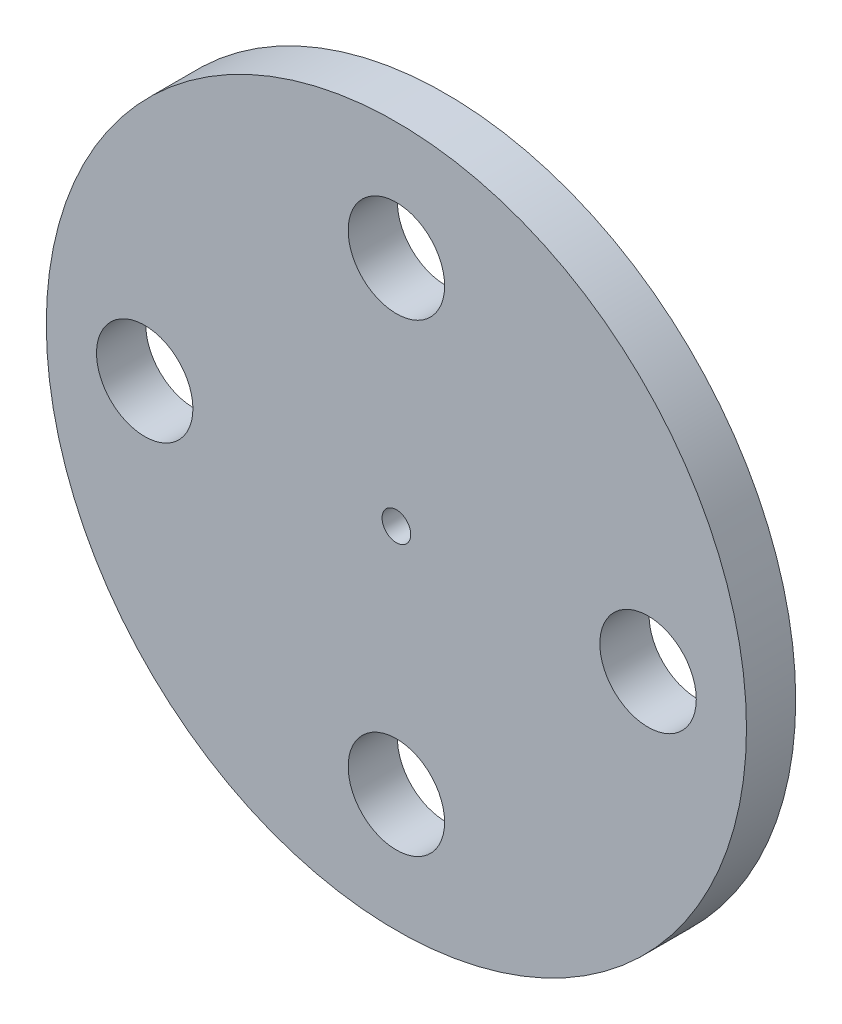
ISO-10303-21;
HEADER;
FILE_DESCRIPTION(('STEP AP214'),'2;1');
FILE_NAME('part.step','',(''),(''),'','','');
FILE_SCHEMA(('AUTOMOTIVE_DESIGN { 1 0 10303 214 1 1 1 1 }'));
ENDSEC;
DATA;
#1=APPLICATION_CONTEXT('core data for automotive mechanical design processes');
#2=APPLICATION_PROTOCOL_DEFINITION('international standard','automotive_design',2000,#1);
#3=PRODUCT_CONTEXT('',#1,'mechanical');
#4=PRODUCT('Part','Part','',(#3));
#5=PRODUCT_RELATED_PRODUCT_CATEGORY('part','',(#4));
#6=PRODUCT_DEFINITION_FORMATION('','',#4);
#7=PRODUCT_DEFINITION_CONTEXT('part definition',#1,'design');
#8=PRODUCT_DEFINITION('design','',#6,#7);
#9=PRODUCT_DEFINITION_SHAPE('','',#8);
#10=(LENGTH_UNIT() NAMED_UNIT(*) SI_UNIT(.MILLI.,.METRE.));
#11=(NAMED_UNIT(*) PLANE_ANGLE_UNIT() SI_UNIT($,.RADIAN.));
#12=(NAMED_UNIT(*) SI_UNIT($,.STERADIAN.) SOLID_ANGLE_UNIT());
#13=UNCERTAINTY_MEASURE_WITH_UNIT(LENGTH_MEASURE(1.E-05),#10,'distance_accuracy_value','');
#14=(GEOMETRIC_REPRESENTATION_CONTEXT(3) GLOBAL_UNCERTAINTY_ASSIGNED_CONTEXT((#13)) GLOBAL_UNIT_ASSIGNED_CONTEXT((#10,
#11,#12)) REPRESENTATION_CONTEXT('',''));
#15=CARTESIAN_POINT('',(0.,0.,0.));
#16=DIRECTION('',(0.,0.,1.));
#17=DIRECTION('',(1.,0.,0.));
#18=AXIS2_PLACEMENT_3D('',#15,#16,#17);
#19=CARTESIAN_POINT('',(0.,0.,3.18));
#20=DIRECTION('',(0.,0.,1.));
#21=DIRECTION('',(1.,0.,0.));
#22=AXIS2_PLACEMENT_3D('',#19,#20,#21);
#23=PLANE('',#22);
#24=CARTESIAN_POINT('',(16.2559285671691,0.,3.18));
#25=DIRECTION('',(0.,0.,1.));
#26=DIRECTION('',(1.,0.,0.));
#27=AXIS2_PLACEMENT_3D('',#24,#25,#26);
#28=CIRCLE('',#27,3.115);
#29=CARTESIAN_POINT('',(19.3709285671691,0.,3.18));
#30=VERTEX_POINT('',#29);
#31=EDGE_CURVE('E72',#30,#30,#28,.T.);
#32=ORIENTED_EDGE('',*,*,#31,.F.);
#33=EDGE_LOOP('',(#32));
#34=FACE_BOUND('',#33,.T.);
#35=CARTESIAN_POINT('',(-16.2559285671691,0.,3.18));
#36=DIRECTION('',(0.,0.,1.));
#37=DIRECTION('',(1.,0.,0.));
#38=AXIS2_PLACEMENT_3D('',#35,#36,#37);
#39=CIRCLE('',#38,3.11280836168759);
#40=CARTESIAN_POINT('',(-13.1431202054815,0.,3.18));
#41=VERTEX_POINT('',#40);
#42=EDGE_CURVE('E56',#41,#41,#39,.T.);
#43=ORIENTED_EDGE('',*,*,#42,.F.);
#44=EDGE_LOOP('',(#43));
#45=FACE_BOUND('',#44,.T.);
#46=CARTESIAN_POINT('',(0.,0.,3.18));
#47=DIRECTION('',(0.,0.,1.));
#48=DIRECTION('',(1.,0.,0.));
#49=AXIS2_PLACEMENT_3D('',#46,#47,#48);
#50=CIRCLE('',#49,22.6142804477584);
#51=CARTESIAN_POINT('',(22.6142804477584,0.,3.18));
#52=VERTEX_POINT('',#51);
#53=EDGE_CURVE('E10',#52,#52,#50,.T.);
#54=ORIENTED_EDGE('',*,*,#53,.T.);
#55=EDGE_LOOP('',(#54));
#56=FACE_BOUND('',#55,.T.);
#57=CARTESIAN_POINT('',(0.,0.,3.18));
#58=DIRECTION('',(0.,0.,1.));
#59=DIRECTION('',(1.,0.,0.));
#60=AXIS2_PLACEMENT_3D('',#57,#58,#59);
#61=CIRCLE('',#60,0.925000000000001);
#62=CARTESIAN_POINT('',(0.925000000000001,0.,3.18));
#63=VERTEX_POINT('',#62);
#64=EDGE_CURVE('E50',#63,#63,#61,.T.);
#65=ORIENTED_EDGE('',*,*,#64,.F.);
#66=EDGE_LOOP('',(#65));
#67=FACE_BOUND('',#66,.T.);
#68=CARTESIAN_POINT('',(0.,-15.,3.18));
#69=DIRECTION('',(0.,0.,1.));
#70=DIRECTION('',(1.,0.,0.));
#71=AXIS2_PLACEMENT_3D('',#68,#69,#70);
#72=CIRCLE('',#71,3.115);
#73=CARTESIAN_POINT('',(3.115,-15.,3.18));
#74=VERTEX_POINT('',#73);
#75=EDGE_CURVE('E64',#74,#74,#72,.T.);
#76=ORIENTED_EDGE('',*,*,#75,.F.);
#77=EDGE_LOOP('',(#76));
#78=FACE_BOUND('',#77,.T.);
#79=CARTESIAN_POINT('',(0.,15.,3.18));
#80=DIRECTION('',(0.,0.,1.));
#81=DIRECTION('',(1.,0.,0.));
#82=AXIS2_PLACEMENT_3D('',#79,#80,#81);
#83=CIRCLE('',#82,3.115);
#84=CARTESIAN_POINT('',(3.115,15.,3.18));
#85=VERTEX_POINT('',#84);
#86=EDGE_CURVE('E80',#85,#85,#83,.T.);
#87=ORIENTED_EDGE('',*,*,#86,.F.);
#88=EDGE_LOOP('',(#87));
#89=FACE_BOUND('',#88,.T.);
#90=ADVANCED_FACE('F37',(#34,#45,#56,#67,#78,#89),#23,.T.);
#91=CARTESIAN_POINT('',(0.,0.,0.));
#92=DIRECTION('',(0.,0.,1.));
#93=DIRECTION('',(1.,0.,0.));
#94=AXIS2_PLACEMENT_3D('',#91,#92,#93);
#95=PLANE('',#94);
#96=CARTESIAN_POINT('',(0.,0.,0.));
#97=DIRECTION('',(0.,0.,1.));
#98=DIRECTION('',(1.,0.,0.));
#99=AXIS2_PLACEMENT_3D('',#96,#97,#98);
#100=CIRCLE('',#99,22.6142804477584);
#101=CARTESIAN_POINT('',(22.6142804477584,0.,0.));
#102=VERTEX_POINT('',#101);
#103=EDGE_CURVE('E41',#102,#102,#100,.T.);
#104=ORIENTED_EDGE('',*,*,#103,.F.);
#105=EDGE_LOOP('',(#104));
#106=FACE_BOUND('',#105,.T.);
#107=CARTESIAN_POINT('',(0.,0.,0.));
#108=DIRECTION('',(0.,0.,1.));
#109=DIRECTION('',(1.,0.,0.));
#110=AXIS2_PLACEMENT_3D('',#107,#108,#109);
#111=CIRCLE('',#110,0.925000000000001);
#112=CARTESIAN_POINT('',(0.925000000000001,0.,0.));
#113=VERTEX_POINT('',#112);
#114=EDGE_CURVE('E52',#113,#113,#111,.T.);
#115=ORIENTED_EDGE('',*,*,#114,.T.);
#116=EDGE_LOOP('',(#115));
#117=FACE_BOUND('',#116,.T.);
#118=CARTESIAN_POINT('',(-16.2559285671691,0.,0.));
#119=DIRECTION('',(0.,0.,1.));
#120=DIRECTION('',(1.,0.,0.));
#121=AXIS2_PLACEMENT_3D('',#118,#119,#120);
#122=CIRCLE('',#121,3.11280836168759);
#123=CARTESIAN_POINT('',(-13.1431202054815,0.,0.));
#124=VERTEX_POINT('',#123);
#125=EDGE_CURVE('E60',#124,#124,#122,.T.);
#126=ORIENTED_EDGE('',*,*,#125,.T.);
#127=EDGE_LOOP('',(#126));
#128=FACE_BOUND('',#127,.T.);
#129=CARTESIAN_POINT('',(0.,-15.,0.));
#130=DIRECTION('',(0.,0.,1.));
#131=DIRECTION('',(1.,0.,0.));
#132=AXIS2_PLACEMENT_3D('',#129,#130,#131);
#133=CIRCLE('',#132,3.115);
#134=CARTESIAN_POINT('',(3.115,-15.,0.));
#135=VERTEX_POINT('',#134);
#136=EDGE_CURVE('E68',#135,#135,#133,.T.);
#137=ORIENTED_EDGE('',*,*,#136,.T.);
#138=EDGE_LOOP('',(#137));
#139=FACE_BOUND('',#138,.T.);
#140=CARTESIAN_POINT('',(16.2559285671691,0.,0.));
#141=DIRECTION('',(0.,0.,1.));
#142=DIRECTION('',(1.,0.,0.));
#143=AXIS2_PLACEMENT_3D('',#140,#141,#142);
#144=CIRCLE('',#143,3.115);
#145=CARTESIAN_POINT('',(19.3709285671691,0.,0.));
#146=VERTEX_POINT('',#145);
#147=EDGE_CURVE('E76',#146,#146,#144,.T.);
#148=ORIENTED_EDGE('',*,*,#147,.T.);
#149=EDGE_LOOP('',(#148));
#150=FACE_BOUND('',#149,.T.);
#151=CARTESIAN_POINT('',(0.,15.,0.));
#152=DIRECTION('',(0.,0.,1.));
#153=DIRECTION('',(1.,0.,0.));
#154=AXIS2_PLACEMENT_3D('',#151,#152,#153);
#155=CIRCLE('',#154,3.115);
#156=CARTESIAN_POINT('',(3.115,15.,0.));
#157=VERTEX_POINT('',#156);
#158=EDGE_CURVE('E84',#157,#157,#155,.T.);
#159=ORIENTED_EDGE('',*,*,#158,.T.);
#160=EDGE_LOOP('',(#159));
#161=FACE_BOUND('',#160,.T.);
#162=ADVANCED_FACE('F96',(#106,#117,#128,#139,#150,#161),#95,.F.);
#163=CARTESIAN_POINT('',(0.,0.,3.18));
#164=DIRECTION('',(0.,0.,-1.));
#165=DIRECTION('',(-1.,0.,0.));
#166=AXIS2_PLACEMENT_3D('',#163,#164,#165);
#167=CYLINDRICAL_SURFACE('',#166,22.6142804477584);
#168=ORIENTED_EDGE('',*,*,#53,.F.);
#169=EDGE_LOOP('',(#168));
#170=FACE_BOUND('',#169,.T.);
#171=ORIENTED_EDGE('',*,*,#103,.T.);
#172=EDGE_LOOP('',(#171));
#173=FACE_BOUND('',#172,.T.);
#174=ADVANCED_FACE('F39',(#170,#173),#167,.T.);
#175=CARTESIAN_POINT('',(0.,0.,3.18));
#176=DIRECTION('',(0.,0.,-1.));
#177=DIRECTION('',(-1.,0.,0.));
#178=AXIS2_PLACEMENT_3D('',#175,#176,#177);
#179=CYLINDRICAL_SURFACE('',#178,0.925000000000001);
#180=ORIENTED_EDGE('',*,*,#64,.T.);
#181=EDGE_LOOP('',(#180));
#182=FACE_BOUND('',#181,.T.);
#183=ORIENTED_EDGE('',*,*,#114,.F.);
#184=EDGE_LOOP('',(#183));
#185=FACE_BOUND('',#184,.T.);
#186=ADVANCED_FACE('F106',(#182,#185),#179,.F.);
#187=CARTESIAN_POINT('',(-16.2559285671691,0.,3.18));
#188=DIRECTION('',(0.,0.,-1.));
#189=DIRECTION('',(-1.,0.,0.));
#190=AXIS2_PLACEMENT_3D('',#187,#188,#189);
#191=CYLINDRICAL_SURFACE('',#190,3.11280836168759);
#192=ORIENTED_EDGE('',*,*,#42,.T.);
#193=EDGE_LOOP('',(#192));
#194=FACE_BOUND('',#193,.T.);
#195=ORIENTED_EDGE('',*,*,#125,.F.);
#196=EDGE_LOOP('',(#195));
#197=FACE_BOUND('',#196,.T.);
#198=ADVANCED_FACE('F109',(#194,#197),#191,.F.);
#199=CARTESIAN_POINT('',(0.,-15.,3.18));
#200=DIRECTION('',(0.,0.,-1.));
#201=DIRECTION('',(-1.,0.,0.));
#202=AXIS2_PLACEMENT_3D('',#199,#200,#201);
#203=CYLINDRICAL_SURFACE('',#202,3.115);
#204=ORIENTED_EDGE('',*,*,#75,.T.);
#205=EDGE_LOOP('',(#204));
#206=FACE_BOUND('',#205,.T.);
#207=ORIENTED_EDGE('',*,*,#136,.F.);
#208=EDGE_LOOP('',(#207));
#209=FACE_BOUND('',#208,.T.);
#210=ADVANCED_FACE('F113',(#206,#209),#203,.F.);
#211=CARTESIAN_POINT('',(16.2559285671691,0.,3.18));
#212=DIRECTION('',(0.,0.,-1.));
#213=DIRECTION('',(-1.,0.,0.));
#214=AXIS2_PLACEMENT_3D('',#211,#212,#213);
#215=CYLINDRICAL_SURFACE('',#214,3.115);
#216=ORIENTED_EDGE('',*,*,#31,.T.);
#217=EDGE_LOOP('',(#216));
#218=FACE_BOUND('',#217,.T.);
#219=ORIENTED_EDGE('',*,*,#147,.F.);
#220=EDGE_LOOP('',(#219));
#221=FACE_BOUND('',#220,.T.);
#222=ADVANCED_FACE('F117',(#218,#221),#215,.F.);
#223=CARTESIAN_POINT('',(0.,15.,3.18));
#224=DIRECTION('',(0.,0.,-1.));
#225=DIRECTION('',(-1.,0.,0.));
#226=AXIS2_PLACEMENT_3D('',#223,#224,#225);
#227=CYLINDRICAL_SURFACE('',#226,3.115);
#228=ORIENTED_EDGE('',*,*,#86,.T.);
#229=EDGE_LOOP('',(#228));
#230=FACE_BOUND('',#229,.T.);
#231=ORIENTED_EDGE('',*,*,#158,.F.);
#232=EDGE_LOOP('',(#231));
#233=FACE_BOUND('',#232,.T.);
#234=ADVANCED_FACE('F92',(#230,#233),#227,.F.);
#235=CLOSED_SHELL('',(#90,#162,#174,#186,#198,#210,#222,#234));
#236=MANIFOLD_SOLID_BREP('B2',#235);
#237=ADVANCED_BREP_SHAPE_REPRESENTATION('',(#18,#236),#14);
#238=SHAPE_DEFINITION_REPRESENTATION(#9,#237);
ENDSEC;
END-ISO-10303-21;
